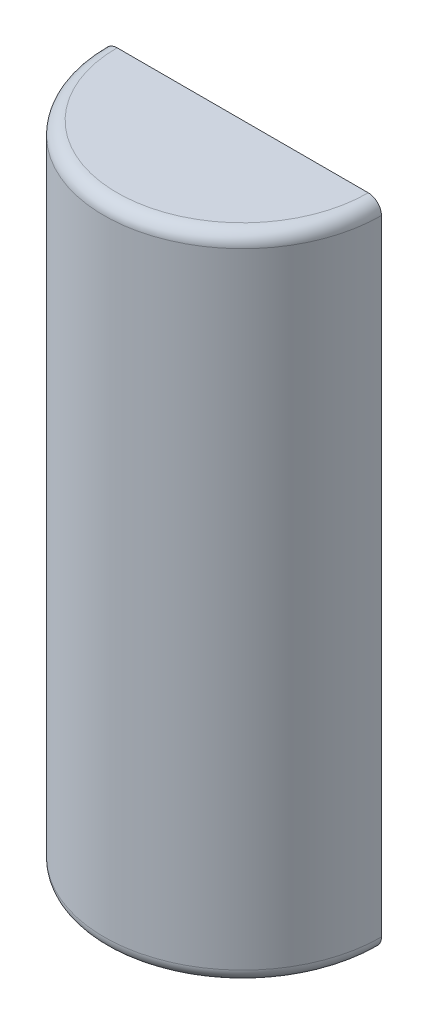
ISO-10303-21;
HEADER;
FILE_DESCRIPTION(('STEP AP214'),'2;1');
FILE_NAME('part.step','',(''),(''),'','','');
FILE_SCHEMA(('AUTOMOTIVE_DESIGN { 1 0 10303 214 1 1 1 1 }'));
ENDSEC;
DATA;
#1=APPLICATION_CONTEXT('core data for automotive mechanical design processes');
#2=APPLICATION_PROTOCOL_DEFINITION('international standard','automotive_design',2000,#1);
#3=PRODUCT_CONTEXT('',#1,'mechanical');
#4=PRODUCT('Part','Part','',(#3));
#5=PRODUCT_RELATED_PRODUCT_CATEGORY('part','',(#4));
#6=PRODUCT_DEFINITION_FORMATION('','',#4);
#7=PRODUCT_DEFINITION_CONTEXT('part definition',#1,'design');
#8=PRODUCT_DEFINITION('design','',#6,#7);
#9=PRODUCT_DEFINITION_SHAPE('','',#8);
#10=(LENGTH_UNIT() NAMED_UNIT(*) SI_UNIT(.MILLI.,.METRE.));
#11=(NAMED_UNIT(*) PLANE_ANGLE_UNIT() SI_UNIT($,.RADIAN.));
#12=(NAMED_UNIT(*) SI_UNIT($,.STERADIAN.) SOLID_ANGLE_UNIT());
#13=UNCERTAINTY_MEASURE_WITH_UNIT(LENGTH_MEASURE(1.E-05),#10,'distance_accuracy_value','');
#14=(GEOMETRIC_REPRESENTATION_CONTEXT(3) GLOBAL_UNCERTAINTY_ASSIGNED_CONTEXT((#13)) GLOBAL_UNIT_ASSIGNED_CONTEXT((#10,
#11,#12)) REPRESENTATION_CONTEXT('',''));
#15=CARTESIAN_POINT('',(0.,0.,0.));
#16=DIRECTION('',(0.,0.,1.));
#17=DIRECTION('',(1.,0.,0.));
#18=AXIS2_PLACEMENT_3D('',#15,#16,#17);
#19=CARTESIAN_POINT('',(0.,628.8,0.));
#20=DIRECTION('',(0.,-1.,0.));
#21=DIRECTION('',(0.,0.,-1.));
#22=AXIS2_PLACEMENT_3D('',#19,#20,#21);
#23=PLANE('',#22);
#24=DIRECTION('',(1.,0.,0.));
#25=VECTOR('',#24,1.);
#26=CARTESIAN_POINT('',(0.,628.8,0.));
#27=LINE('',#26,#25);
#28=CARTESIAN_POINT('',(-121.285,628.8,8.46928628363179E-13));
#29=VERTEX_POINT('',#28);
#30=CARTESIAN_POINT('',(121.285,628.8,-8.46928628363179E-13));
#31=VERTEX_POINT('',#30);
#32=EDGE_CURVE('E103',#29,#31,#27,.T.);
#33=ORIENTED_EDGE('',*,*,#32,.F.);
#34=CARTESIAN_POINT('',(0.,628.8,0.));
#35=DIRECTION('',(0.,-1.,0.));
#36=DIRECTION('',(0.,0.,-1.));
#37=AXIS2_PLACEMENT_3D('',#34,#35,#36);
#38=CIRCLE('',#37,121.285);
#39=EDGE_CURVE('E11',#29,#31,#38,.F.);
#40=ORIENTED_EDGE('',*,*,#39,.T.);
#41=EDGE_LOOP('',(#33,#40));
#42=FACE_BOUND('',#41,.T.);
#43=ADVANCED_FACE('F33',(#42),#23,.F.);
#44=CARTESIAN_POINT('',(0.,0.,0.));
#45=DIRECTION('',(0.,-1.,0.));
#46=DIRECTION('',(0.,0.,-1.));
#47=AXIS2_PLACEMENT_3D('',#44,#45,#46);
#48=CYLINDRICAL_SURFACE('',#47,133.985);
#49=DIRECTION('',(0.,-1.,0.));
#50=VECTOR('',#49,1.);
#51=CARTESIAN_POINT('',(-133.985,0.,0.));
#52=LINE('',#51,#50);
#53=CARTESIAN_POINT('',(-133.985,616.1,0.));
#54=VERTEX_POINT('',#53);
#55=CARTESIAN_POINT('',(-133.985,12.7,0.));
#56=VERTEX_POINT('',#55);
#57=EDGE_CURVE('E100',#54,#56,#52,.T.);
#58=ORIENTED_EDGE('',*,*,#57,.T.);
#59=CARTESIAN_POINT('',(0.,12.7,0.));
#60=DIRECTION('',(0.,1.,0.));
#61=DIRECTION('',(0.,0.,1.));
#62=AXIS2_PLACEMENT_3D('',#59,#60,#61);
#63=CIRCLE('',#62,133.985);
#64=CARTESIAN_POINT('',(133.985,12.7,-9.35612254369794E-13));
#65=VERTEX_POINT('',#64);
#66=EDGE_CURVE('E41',#56,#65,#63,.T.);
#67=ORIENTED_EDGE('',*,*,#66,.T.);
#68=DIRECTION('',(0.,-1.,0.));
#69=VECTOR('',#68,1.);
#70=CARTESIAN_POINT('',(133.985,0.,-9.35612254369794E-13));
#71=LINE('',#70,#69);
#72=CARTESIAN_POINT('',(133.985,616.1,-9.35612254369794E-13));
#73=VERTEX_POINT('',#72);
#74=EDGE_CURVE('E77',#73,#65,#71,.T.);
#75=ORIENTED_EDGE('',*,*,#74,.F.);
#76=CARTESIAN_POINT('',(0.,616.1,0.));
#77=DIRECTION('',(0.,-1.,0.));
#78=DIRECTION('',(0.,0.,-1.));
#79=AXIS2_PLACEMENT_3D('',#76,#77,#78);
#80=CIRCLE('',#79,133.985);
#81=EDGE_CURVE('E95',#73,#54,#80,.T.);
#82=ORIENTED_EDGE('',*,*,#81,.T.);
#83=EDGE_LOOP('',(#58,#67,#75,#82));
#84=FACE_BOUND('',#83,.T.);
#85=ADVANCED_FACE('F99',(#84),#48,.T.);
#86=CARTESIAN_POINT('',(0.,0.,0.));
#87=DIRECTION('',(0.,1.,0.));
#88=DIRECTION('',(0.,0.,1.));
#89=AXIS2_PLACEMENT_3D('',#86,#87,#88);
#90=PLANE('',#89);
#91=DIRECTION('',(-1.,0.,0.));
#92=VECTOR('',#91,1.);
#93=CARTESIAN_POINT('',(0.,0.,0.));
#94=LINE('',#93,#92);
#95=CARTESIAN_POINT('',(121.285,0.,-8.46928628363179E-13));
#96=VERTEX_POINT('',#95);
#97=CARTESIAN_POINT('',(-121.285,0.,8.46928628363179E-13));
#98=VERTEX_POINT('',#97);
#99=EDGE_CURVE('E76',#96,#98,#94,.T.);
#100=ORIENTED_EDGE('',*,*,#99,.F.);
#101=CARTESIAN_POINT('',(0.,0.,0.));
#102=DIRECTION('',(0.,1.,0.));
#103=DIRECTION('',(0.,0.,1.));
#104=AXIS2_PLACEMENT_3D('',#101,#102,#103);
#105=CIRCLE('',#104,121.285);
#106=EDGE_CURVE('E86',#96,#98,#105,.F.);
#107=ORIENTED_EDGE('',*,*,#106,.T.);
#108=EDGE_LOOP('',(#100,#107));
#109=FACE_BOUND('',#108,.T.);
#110=ADVANCED_FACE('F85',(#109),#90,.F.);
#111=CARTESIAN_POINT('',(0.,0.,0.));
#112=DIRECTION('',(0.,0.,-1.));
#113=DIRECTION('',(-1.,0.,0.));
#114=AXIS2_PLACEMENT_3D('',#111,#112,#113);
#115=PLANE('',#114);
#116=ORIENTED_EDGE('',*,*,#99,.T.);
#117=CARTESIAN_POINT('',(-121.285,12.7,8.46928628363179E-13));
#118=DIRECTION('',(0.,0.,-1.));
#119=DIRECTION('',(-1.,0.,0.));
#120=AXIS2_PLACEMENT_3D('',#117,#118,#119);
#121=CIRCLE('',#120,12.7);
#122=EDGE_CURVE('E80',#98,#56,#121,.T.);
#123=ORIENTED_EDGE('',*,*,#122,.T.);
#124=ORIENTED_EDGE('',*,*,#57,.F.);
#125=CARTESIAN_POINT('',(-121.285,616.1,8.46928628363179E-13));
#126=DIRECTION('',(0.,0.,-1.));
#127=DIRECTION('',(-1.,0.,0.));
#128=AXIS2_PLACEMENT_3D('',#125,#126,#127);
#129=CIRCLE('',#128,12.7);
#130=EDGE_CURVE('E81',#54,#29,#129,.T.);
#131=ORIENTED_EDGE('',*,*,#130,.T.);
#132=ORIENTED_EDGE('',*,*,#32,.T.);
#133=CARTESIAN_POINT('',(121.285,616.1,-8.46928628363179E-13));
#134=DIRECTION('',(0.,0.,-1.));
#135=DIRECTION('',(-1.,0.,0.));
#136=AXIS2_PLACEMENT_3D('',#133,#134,#135);
#137=CIRCLE('',#136,12.7);
#138=EDGE_CURVE('E54',#31,#73,#137,.T.);
#139=ORIENTED_EDGE('',*,*,#138,.T.);
#140=ORIENTED_EDGE('',*,*,#74,.T.);
#141=CARTESIAN_POINT('',(121.285,12.7,-8.46928628363179E-13));
#142=DIRECTION('',(0.,0.,-1.));
#143=DIRECTION('',(-1.,0.,0.));
#144=AXIS2_PLACEMENT_3D('',#141,#142,#143);
#145=CIRCLE('',#144,12.7);
#146=EDGE_CURVE('E73',#65,#96,#145,.T.);
#147=ORIENTED_EDGE('',*,*,#146,.T.);
#148=EDGE_LOOP('',(#116,#123,#124,#131,#132,#139,#140,#147));
#149=FACE_BOUND('',#148,.T.);
#150=ADVANCED_FACE('F75',(#149),#115,.T.);
#151=CARTESIAN_POINT('',(0.,12.7,0.));
#152=DIRECTION('',(0.,1.,0.));
#153=DIRECTION('',(0.,0.,1.));
#154=AXIS2_PLACEMENT_3D('',#151,#152,#153);
#155=TOROIDAL_SURFACE('',#154,121.285,12.7);
#156=ORIENTED_EDGE('',*,*,#146,.F.);
#157=ORIENTED_EDGE('',*,*,#66,.F.);
#158=ORIENTED_EDGE('',*,*,#122,.F.);
#159=ORIENTED_EDGE('',*,*,#106,.F.);
#160=EDGE_LOOP('',(#156,#157,#158,#159));
#161=FACE_BOUND('',#160,.T.);
#162=ADVANCED_FACE('F88',(#161),#155,.T.);
#163=CARTESIAN_POINT('',(0.,616.1,0.));
#164=DIRECTION('',(0.,-1.,0.));
#165=DIRECTION('',(0.,0.,-1.));
#166=AXIS2_PLACEMENT_3D('',#163,#164,#165);
#167=TOROIDAL_SURFACE('',#166,121.285,12.7);
#168=ORIENTED_EDGE('',*,*,#138,.F.);
#169=ORIENTED_EDGE('',*,*,#39,.F.);
#170=ORIENTED_EDGE('',*,*,#130,.F.);
#171=ORIENTED_EDGE('',*,*,#81,.F.);
#172=EDGE_LOOP('',(#168,#169,#170,#171));
#173=FACE_BOUND('',#172,.T.);
#174=ADVANCED_FACE('F35',(#173),#167,.T.);
#175=CLOSED_SHELL('',(#43,#85,#110,#150,#162,#174));
#176=MANIFOLD_SOLID_BREP('B2',#175);
#177=ADVANCED_BREP_SHAPE_REPRESENTATION('',(#18,#176),#14);
#178=SHAPE_DEFINITION_REPRESENTATION(#9,#177);
ENDSEC;
END-ISO-10303-21;
